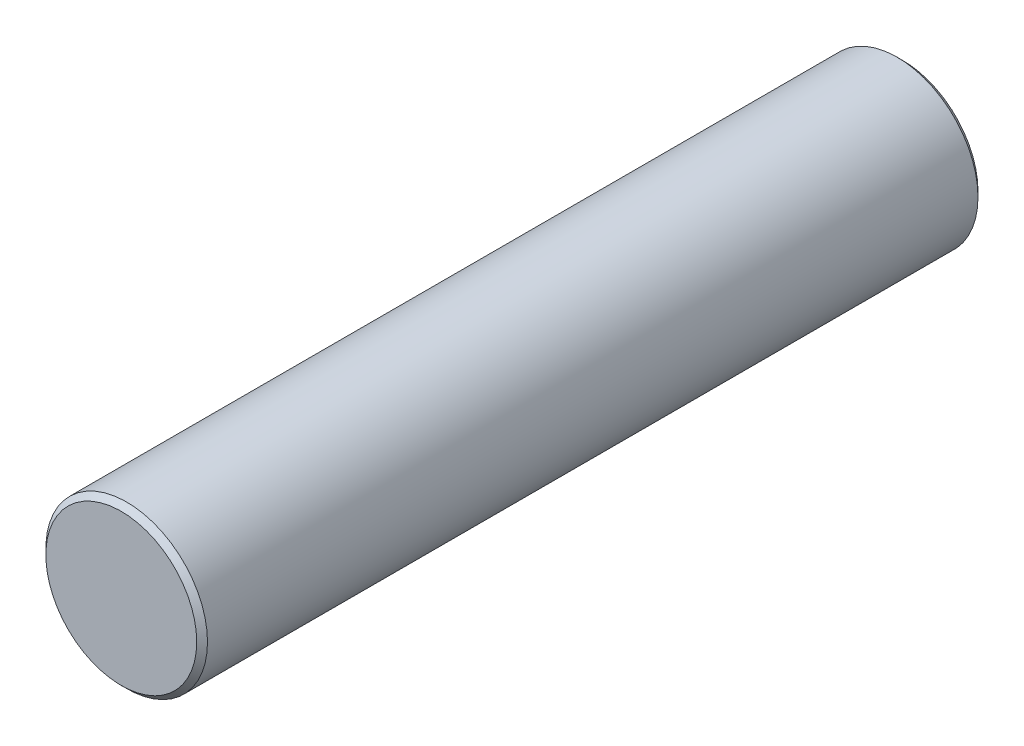
ISO-10303-21;
HEADER;
FILE_DESCRIPTION(('STEP AP214'),'2;1');
FILE_NAME('part.step','',(''),(''),'','','');
FILE_SCHEMA(('AUTOMOTIVE_DESIGN { 1 0 10303 214 1 1 1 1 }'));
ENDSEC;
DATA;
#1=APPLICATION_CONTEXT('core data for automotive mechanical design processes');
#2=APPLICATION_PROTOCOL_DEFINITION('international standard','automotive_design',2000,#1);
#3=PRODUCT_CONTEXT('',#1,'mechanical');
#4=PRODUCT('Part','Part','',(#3));
#5=PRODUCT_RELATED_PRODUCT_CATEGORY('part','',(#4));
#6=PRODUCT_DEFINITION_FORMATION('','',#4);
#7=PRODUCT_DEFINITION_CONTEXT('part definition',#1,'design');
#8=PRODUCT_DEFINITION('design','',#6,#7);
#9=PRODUCT_DEFINITION_SHAPE('','',#8);
#10=(LENGTH_UNIT() NAMED_UNIT(*) SI_UNIT(.MILLI.,.METRE.));
#11=(NAMED_UNIT(*) PLANE_ANGLE_UNIT() SI_UNIT($,.RADIAN.));
#12=(NAMED_UNIT(*) SI_UNIT($,.STERADIAN.) SOLID_ANGLE_UNIT());
#13=UNCERTAINTY_MEASURE_WITH_UNIT(LENGTH_MEASURE(1.E-05),#10,'distance_accuracy_value','');
#14=(GEOMETRIC_REPRESENTATION_CONTEXT(3) GLOBAL_UNCERTAINTY_ASSIGNED_CONTEXT((#13)) GLOBAL_UNIT_ASSIGNED_CONTEXT((#10,
#11,#12)) REPRESENTATION_CONTEXT('',''));
#15=CARTESIAN_POINT('',(0.,0.,0.));
#16=DIRECTION('',(0.,0.,1.));
#17=DIRECTION('',(1.,0.,0.));
#18=AXIS2_PLACEMENT_3D('',#15,#16,#17);
#19=CARTESIAN_POINT('',(0.,0.,7.25));
#20=DIRECTION('',(0.,0.,-1.));
#21=DIRECTION('',(-1.,0.,0.));
#22=AXIS2_PLACEMENT_3D('',#19,#20,#21);
#23=CYLINDRICAL_SURFACE('',#22,0.75);
#24=CARTESIAN_POINT('',(0.,0.,0.0500000000000032));
#25=DIRECTION('',(0.,0.,1.));
#26=DIRECTION('',(1.,0.,0.));
#27=AXIS2_PLACEMENT_3D('',#24,#25,#26);
#28=CIRCLE('',#27,0.75);
#29=CARTESIAN_POINT('',(0.75,0.,0.0500000000000032));
#30=VERTEX_POINT('',#29);
#31=EDGE_CURVE('E75',#30,#30,#28,.T.);
#32=ORIENTED_EDGE('',*,*,#31,.T.);
#33=EDGE_LOOP('',(#32));
#34=FACE_BOUND('',#33,.T.);
#35=CARTESIAN_POINT('',(0.,0.,7.2));
#36=DIRECTION('',(0.,0.,1.));
#37=DIRECTION('',(1.,0.,0.));
#38=AXIS2_PLACEMENT_3D('',#35,#36,#37);
#39=CIRCLE('',#38,0.75);
#40=CARTESIAN_POINT('',(0.75,0.,7.2));
#41=VERTEX_POINT('',#40);
#42=EDGE_CURVE('E79',#41,#41,#39,.F.);
#43=ORIENTED_EDGE('',*,*,#42,.T.);
#44=EDGE_LOOP('',(#43));
#45=FACE_BOUND('',#44,.T.);
#46=ADVANCED_FACE('F64',(#34,#45),#23,.T.);
#47=CARTESIAN_POINT('',(0.,0.,7.25));
#48=DIRECTION('',(0.,0.,1.));
#49=DIRECTION('',(1.,0.,0.));
#50=AXIS2_PLACEMENT_3D('',#47,#48,#49);
#51=PLANE('',#50);
#52=CARTESIAN_POINT('',(0.,0.,7.25));
#53=DIRECTION('',(0.,0.,1.));
#54=DIRECTION('',(1.,0.,0.));
#55=AXIS2_PLACEMENT_3D('',#52,#53,#54);
#56=CIRCLE('',#55,0.700000000000003);
#57=CARTESIAN_POINT('',(0.700000000000003,0.,7.25));
#58=VERTEX_POINT('',#57);
#59=EDGE_CURVE('E13',#58,#58,#56,.T.);
#60=ORIENTED_EDGE('',*,*,#59,.T.);
#61=EDGE_LOOP('',(#60));
#62=FACE_BOUND('',#61,.T.);
#63=ADVANCED_FACE('F95',(#62),#51,.T.);
#64=CARTESIAN_POINT('',(0.,0.,0.));
#65=DIRECTION('',(0.,0.,1.));
#66=DIRECTION('',(1.,0.,0.));
#67=AXIS2_PLACEMENT_3D('',#64,#65,#66);
#68=PLANE('',#67);
#69=CARTESIAN_POINT('',(0.,0.,0.));
#70=DIRECTION('',(0.,0.,1.));
#71=DIRECTION('',(1.,0.,0.));
#72=AXIS2_PLACEMENT_3D('',#69,#70,#71);
#73=CIRCLE('',#72,0.699999999999997);
#74=CARTESIAN_POINT('',(0.699999999999997,0.,0.));
#75=VERTEX_POINT('',#74);
#76=EDGE_CURVE('E71',#75,#75,#73,.F.);
#77=ORIENTED_EDGE('',*,*,#76,.T.);
#78=EDGE_LOOP('',(#77));
#79=FACE_BOUND('',#78,.T.);
#80=ADVANCED_FACE('F92',(#79),#68,.F.);
#81=CARTESIAN_POINT('',(0.,0.,0.0500000000000032));
#82=DIRECTION('',(0.,0.,1.));
#83=DIRECTION('',(1.,0.,0.));
#84=AXIS2_PLACEMENT_3D('',#81,#82,#83);
#85=CONICAL_SURFACE('',#84,0.75,0.785398163397453);
#86=ORIENTED_EDGE('',*,*,#76,.F.);
#87=EDGE_LOOP('',(#86));
#88=FACE_BOUND('',#87,.T.);
#89=ORIENTED_EDGE('',*,*,#31,.F.);
#90=EDGE_LOOP('',(#89));
#91=FACE_BOUND('',#90,.T.);
#92=ADVANCED_FACE('F88',(#88,#91),#85,.T.);
#93=CARTESIAN_POINT('',(0.,0.,7.25));
#94=DIRECTION('',(0.,0.,-1.));
#95=DIRECTION('',(-1.,0.,0.));
#96=AXIS2_PLACEMENT_3D('',#93,#94,#95);
#97=CONICAL_SURFACE('',#96,0.700000000000003,0.785398163397453);
#98=ORIENTED_EDGE('',*,*,#42,.F.);
#99=EDGE_LOOP('',(#98));
#100=FACE_BOUND('',#99,.T.);
#101=ORIENTED_EDGE('',*,*,#59,.F.);
#102=EDGE_LOOP('',(#101));
#103=FACE_BOUND('',#102,.T.);
#104=ADVANCED_FACE('F66',(#100,#103),#97,.T.);
#105=CLOSED_SHELL('',(#46,#63,#80,#92,#104));
#106=MANIFOLD_SOLID_BREP('B2',#105);
#107=ADVANCED_BREP_SHAPE_REPRESENTATION('',(#18,#106),#14);
#108=SHAPE_DEFINITION_REPRESENTATION(#9,#107);
ENDSEC;
END-ISO-10303-21;
